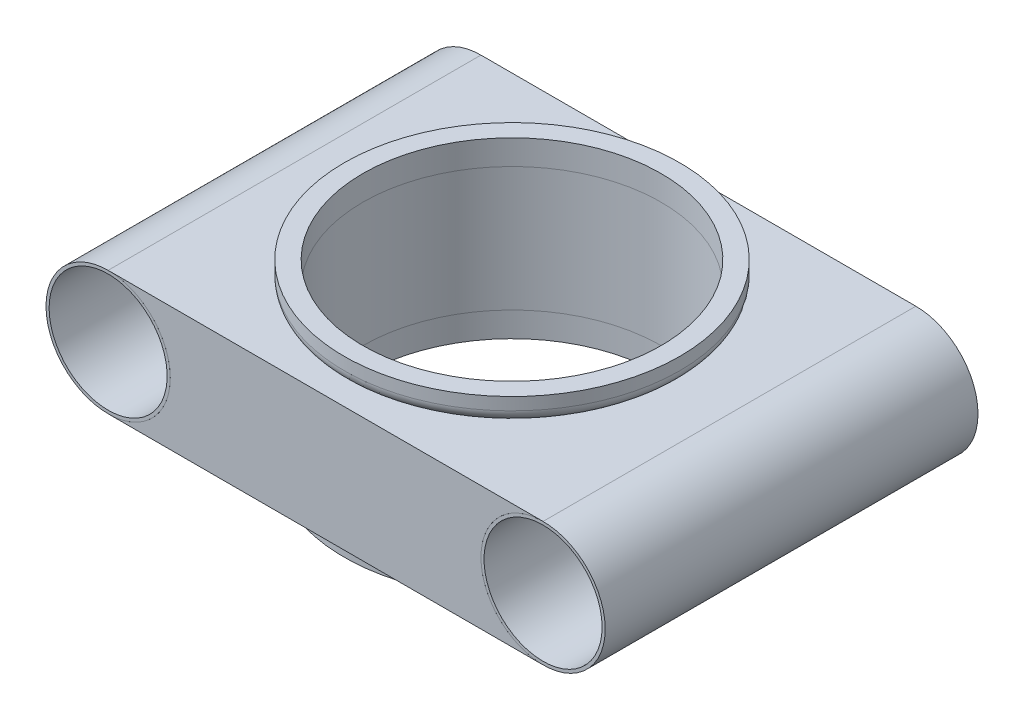
ISO-10303-21;
HEADER;
FILE_DESCRIPTION(('STEP AP214'),'2;1');
FILE_NAME('part.step','',(''),(''),'','','');
FILE_SCHEMA(('AUTOMOTIVE_DESIGN { 1 0 10303 214 1 1 1 1 }'));
ENDSEC;
DATA;
#1=APPLICATION_CONTEXT('core data for automotive mechanical design processes');
#2=APPLICATION_PROTOCOL_DEFINITION('international standard','automotive_design',2000,#1);
#3=PRODUCT_CONTEXT('',#1,'mechanical');
#4=PRODUCT('Part','Part','',(#3));
#5=PRODUCT_RELATED_PRODUCT_CATEGORY('part','',(#4));
#6=PRODUCT_DEFINITION_FORMATION('','',#4);
#7=PRODUCT_DEFINITION_CONTEXT('part definition',#1,'design');
#8=PRODUCT_DEFINITION('design','',#6,#7);
#9=PRODUCT_DEFINITION_SHAPE('','',#8);
#10=(LENGTH_UNIT() NAMED_UNIT(*) SI_UNIT(.MILLI.,.METRE.));
#11=(NAMED_UNIT(*) PLANE_ANGLE_UNIT() SI_UNIT($,.RADIAN.));
#12=(NAMED_UNIT(*) SI_UNIT($,.STERADIAN.) SOLID_ANGLE_UNIT());
#13=UNCERTAINTY_MEASURE_WITH_UNIT(LENGTH_MEASURE(1.E-05),#10,'distance_accuracy_value','');
#14=(GEOMETRIC_REPRESENTATION_CONTEXT(3) GLOBAL_UNCERTAINTY_ASSIGNED_CONTEXT((#13)) GLOBAL_UNIT_ASSIGNED_CONTEXT((#10,
#11,#12)) REPRESENTATION_CONTEXT('',''));
#15=CARTESIAN_POINT('',(0.,0.,0.));
#16=DIRECTION('',(0.,0.,1.));
#17=DIRECTION('',(1.,0.,0.));
#18=AXIS2_PLACEMENT_3D('',#15,#16,#17);
#19=CARTESIAN_POINT('',(0.,-7.,0.));
#20=DIRECTION('',(0.,-1.,0.));
#21=DIRECTION('',(-1.,0.,0.));
#22=AXIS2_PLACEMENT_3D('',#19,#20,#21);
#23=PLANE('',#22);
#24=CARTESIAN_POINT('',(0.,-7.,0.));
#25=DIRECTION('',(0.,1.,0.));
#26=DIRECTION('',(-1.,0.,0.));
#27=AXIS2_PLACEMENT_3D('',#24,#25,#26);
#28=CIRCLE('',#27,13.5);
#29=CARTESIAN_POINT('',(-13.5,-7.,0.));
#30=VERTEX_POINT('',#29);
#31=EDGE_CURVE('E63',#30,#30,#28,.T.);
#32=ORIENTED_EDGE('',*,*,#31,.F.);
#33=EDGE_LOOP('',(#32));
#34=FACE_BOUND('',#33,.T.);
#35=CARTESIAN_POINT('',(0.,-7.,0.));
#36=DIRECTION('',(0.,1.,0.));
#37=DIRECTION('',(-1.,0.,0.));
#38=AXIS2_PLACEMENT_3D('',#35,#36,#37);
#39=CIRCLE('',#38,12.);
#40=CARTESIAN_POINT('',(-12.,-7.,0.));
#41=VERTEX_POINT('',#40);
#42=EDGE_CURVE('E67',#41,#41,#39,.T.);
#43=ORIENTED_EDGE('',*,*,#42,.T.);
#44=EDGE_LOOP('',(#43));
#45=FACE_BOUND('',#44,.T.);
#46=ADVANCED_FACE('F52',(#34,#45),#23,.T.);
#47=CARTESIAN_POINT('',(0.,-5.,0.));
#48=DIRECTION('',(0.,-1.,0.));
#49=DIRECTION('',(-1.,0.,0.));
#50=AXIS2_PLACEMENT_3D('',#47,#48,#49);
#51=PLANE('',#50);
#52=CARTESIAN_POINT('',(0.,-5.,0.));
#53=DIRECTION('',(0.,1.,0.));
#54=DIRECTION('',(-1.,0.,0.));
#55=AXIS2_PLACEMENT_3D('',#52,#53,#54);
#56=CIRCLE('',#55,12.5);
#57=CARTESIAN_POINT('',(-12.5,-5.,0.));
#58=VERTEX_POINT('',#57);
#59=EDGE_CURVE('E12',#58,#58,#56,.F.);
#60=ORIENTED_EDGE('',*,*,#59,.F.);
#61=EDGE_LOOP('',(#60));
#62=FACE_BOUND('',#61,.T.);
#63=CARTESIAN_POINT('',(0.,-5.,0.));
#64=DIRECTION('',(0.,1.,0.));
#65=DIRECTION('',(-1.,0.,0.));
#66=AXIS2_PLACEMENT_3D('',#63,#64,#65);
#67=CIRCLE('',#66,12.);
#68=CARTESIAN_POINT('',(-12.,-5.,0.));
#69=VERTEX_POINT('',#68);
#70=EDGE_CURVE('E70',#69,#69,#67,.T.);
#71=ORIENTED_EDGE('',*,*,#70,.F.);
#72=EDGE_LOOP('',(#71));
#73=FACE_BOUND('',#72,.T.);
#74=ADVANCED_FACE('F84',(#62,#73),#51,.F.);
#75=CARTESIAN_POINT('',(0.,-7.,0.));
#76=DIRECTION('',(0.,1.,0.));
#77=DIRECTION('',(1.,0.,0.));
#78=AXIS2_PLACEMENT_3D('',#75,#76,#77);
#79=CYLINDRICAL_SURFACE('',#78,13.5);
#80=CARTESIAN_POINT('',(0.,-6.,0.));
#81=DIRECTION('',(0.,1.,0.));
#82=DIRECTION('',(-1.,0.,0.));
#83=AXIS2_PLACEMENT_3D('',#80,#81,#82);
#84=CIRCLE('',#83,13.5);
#85=CARTESIAN_POINT('',(-13.5,-6.,0.));
#86=VERTEX_POINT('',#85);
#87=EDGE_CURVE('E59',#86,#86,#84,.T.);
#88=ORIENTED_EDGE('',*,*,#87,.F.);
#89=EDGE_LOOP('',(#88));
#90=FACE_BOUND('',#89,.T.);
#91=ORIENTED_EDGE('',*,*,#31,.T.);
#92=EDGE_LOOP('',(#91));
#93=FACE_BOUND('',#92,.T.);
#94=ADVANCED_FACE('F80',(#90,#93),#79,.T.);
#95=CARTESIAN_POINT('',(0.,-7.,0.));
#96=DIRECTION('',(0.,1.,0.));
#97=DIRECTION('',(1.,0.,0.));
#98=AXIS2_PLACEMENT_3D('',#95,#96,#97);
#99=CYLINDRICAL_SURFACE('',#98,12.);
#100=ORIENTED_EDGE('',*,*,#42,.F.);
#101=EDGE_LOOP('',(#100));
#102=FACE_BOUND('',#101,.T.);
#103=ORIENTED_EDGE('',*,*,#70,.T.);
#104=EDGE_LOOP('',(#103));
#105=FACE_BOUND('',#104,.T.);
#106=ADVANCED_FACE('F77',(#102,#105),#99,.F.);
#107=CARTESIAN_POINT('',(0.,-6.,0.));
#108=DIRECTION('',(0.,-1.,0.));
#109=DIRECTION('',(-1.,0.,0.));
#110=AXIS2_PLACEMENT_3D('',#107,#108,#109);
#111=TOROIDAL_SURFACE('',#110,12.5,1.);
#112=ORIENTED_EDGE('',*,*,#59,.T.);
#113=EDGE_LOOP('',(#112));
#114=FACE_BOUND('',#113,.T.);
#115=ORIENTED_EDGE('',*,*,#87,.T.);
#116=EDGE_LOOP('',(#115));
#117=FACE_BOUND('',#116,.T.);
#118=ADVANCED_FACE('F54',(#114,#117),#111,.T.);
#119=CLOSED_SHELL('',(#46,#74,#94,#106,#118));
#120=MANIFOLD_SOLID_BREP('B2',#119);
#121=CARTESIAN_POINT('',(0.,7.,0.));
#122=DIRECTION('',(0.,1.,0.));
#123=DIRECTION('',(-1.,0.,0.));
#124=AXIS2_PLACEMENT_3D('',#121,#122,#123);
#125=PLANE('',#124);
#126=CARTESIAN_POINT('',(0.,7.,0.));
#127=DIRECTION('',(0.,1.,0.));
#128=DIRECTION('',(-1.,0.,0.));
#129=AXIS2_PLACEMENT_3D('',#126,#127,#128);
#130=CIRCLE('',#129,13.5);
#131=CARTESIAN_POINT('',(-13.5,7.,0.));
#132=VERTEX_POINT('',#131);
#133=EDGE_CURVE('E149',#132,#132,#130,.T.);
#134=ORIENTED_EDGE('',*,*,#133,.T.);
#135=EDGE_LOOP('',(#134));
#136=FACE_BOUND('',#135,.T.);
#137=CARTESIAN_POINT('',(0.,7.,0.));
#138=DIRECTION('',(0.,1.,0.));
#139=DIRECTION('',(-1.,0.,0.));
#140=AXIS2_PLACEMENT_3D('',#137,#138,#139);
#141=CIRCLE('',#140,12.);
#142=CARTESIAN_POINT('',(-12.,7.,0.));
#143=VERTEX_POINT('',#142);
#144=EDGE_CURVE('E153',#143,#143,#141,.T.);
#145=ORIENTED_EDGE('',*,*,#144,.F.);
#146=EDGE_LOOP('',(#145));
#147=FACE_BOUND('',#146,.T.);
#148=ADVANCED_FACE('F138',(#136,#147),#125,.T.);
#149=CARTESIAN_POINT('',(0.,5.,0.));
#150=DIRECTION('',(0.,1.,0.));
#151=DIRECTION('',(-1.,0.,0.));
#152=AXIS2_PLACEMENT_3D('',#149,#150,#151);
#153=PLANE('',#152);
#154=CARTESIAN_POINT('',(0.,5.,0.));
#155=DIRECTION('',(0.,1.,0.));
#156=DIRECTION('',(-1.,0.,0.));
#157=AXIS2_PLACEMENT_3D('',#154,#155,#156);
#158=CIRCLE('',#157,12.5);
#159=CARTESIAN_POINT('',(-12.5,5.,0.));
#160=VERTEX_POINT('',#159);
#161=EDGE_CURVE('E51',#160,#160,#158,.F.);
#162=ORIENTED_EDGE('',*,*,#161,.T.);
#163=EDGE_LOOP('',(#162));
#164=FACE_BOUND('',#163,.T.);
#165=CARTESIAN_POINT('',(0.,5.,0.));
#166=DIRECTION('',(0.,1.,0.));
#167=DIRECTION('',(-1.,0.,0.));
#168=AXIS2_PLACEMENT_3D('',#165,#166,#167);
#169=CIRCLE('',#168,12.);
#170=CARTESIAN_POINT('',(-12.,5.,0.));
#171=VERTEX_POINT('',#170);
#172=EDGE_CURVE('E156',#171,#171,#169,.T.);
#173=ORIENTED_EDGE('',*,*,#172,.T.);
#174=EDGE_LOOP('',(#173));
#175=FACE_BOUND('',#174,.T.);
#176=ADVANCED_FACE('F166',(#164,#175),#153,.F.);
#177=CARTESIAN_POINT('',(0.,7.,0.));
#178=DIRECTION('',(0.,-1.,0.));
#179=DIRECTION('',(1.,0.,0.));
#180=AXIS2_PLACEMENT_3D('',#177,#178,#179);
#181=CYLINDRICAL_SURFACE('',#180,13.5);
#182=CARTESIAN_POINT('',(0.,6.,0.));
#183=DIRECTION('',(0.,1.,0.));
#184=DIRECTION('',(-1.,0.,0.));
#185=AXIS2_PLACEMENT_3D('',#182,#183,#184);
#186=CIRCLE('',#185,13.5);
#187=CARTESIAN_POINT('',(-13.5,6.,0.));
#188=VERTEX_POINT('',#187);
#189=EDGE_CURVE('E145',#188,#188,#186,.T.);
#190=ORIENTED_EDGE('',*,*,#189,.T.);
#191=EDGE_LOOP('',(#190));
#192=FACE_BOUND('',#191,.T.);
#193=ORIENTED_EDGE('',*,*,#133,.F.);
#194=EDGE_LOOP('',(#193));
#195=FACE_BOUND('',#194,.T.);
#196=ADVANCED_FACE('F172',(#192,#195),#181,.T.);
#197=CARTESIAN_POINT('',(0.,7.,0.));
#198=DIRECTION('',(0.,-1.,0.));
#199=DIRECTION('',(1.,0.,0.));
#200=AXIS2_PLACEMENT_3D('',#197,#198,#199);
#201=CYLINDRICAL_SURFACE('',#200,12.);
#202=ORIENTED_EDGE('',*,*,#144,.T.);
#203=EDGE_LOOP('',(#202));
#204=FACE_BOUND('',#203,.T.);
#205=ORIENTED_EDGE('',*,*,#172,.F.);
#206=EDGE_LOOP('',(#205));
#207=FACE_BOUND('',#206,.T.);
#208=ADVANCED_FACE('F162',(#204,#207),#201,.F.);
#209=CARTESIAN_POINT('',(0.,6.,0.));
#210=DIRECTION('',(0.,1.,0.));
#211=DIRECTION('',(-1.,0.,0.));
#212=AXIS2_PLACEMENT_3D('',#209,#210,#211);
#213=TOROIDAL_SURFACE('',#212,12.5,1.);
#214=ORIENTED_EDGE('',*,*,#161,.F.);
#215=EDGE_LOOP('',(#214));
#216=FACE_BOUND('',#215,.T.);
#217=ORIENTED_EDGE('',*,*,#189,.F.);
#218=EDGE_LOOP('',(#217));
#219=FACE_BOUND('',#218,.T.);
#220=ADVANCED_FACE('F140',(#216,#219),#213,.T.);
#221=CLOSED_SHELL('',(#148,#176,#196,#208,#220));
#222=MANIFOLD_SOLID_BREP('B7',#221);
#223=CARTESIAN_POINT('',(17.5,0.,15.));
#224=DIRECTION('',(0.,0.,-1.));
#225=DIRECTION('',(-1.,0.,0.));
#226=AXIS2_PLACEMENT_3D('',#223,#224,#225);
#227=CYLINDRICAL_SURFACE('',#226,5.);
#228=CARTESIAN_POINT('',(17.5,0.,-15.));
#229=DIRECTION('',(0.,0.,1.));
#230=DIRECTION('',(1.,0.,0.));
#231=AXIS2_PLACEMENT_3D('',#228,#229,#230);
#232=CIRCLE('',#231,5.);
#233=CARTESIAN_POINT('',(17.5,5.,-15.));
#234=VERTEX_POINT('',#233);
#235=CARTESIAN_POINT('',(17.5,-5.,-15.));
#236=VERTEX_POINT('',#235);
#237=EDGE_CURVE('E285',#234,#236,#232,.T.);
#238=ORIENTED_EDGE('',*,*,#237,.F.);
#239=DIRECTION('',(0.,0.,-1.));
#240=VECTOR('',#239,1.);
#241=CARTESIAN_POINT('',(17.5,5.,15.));
#242=LINE('',#241,#240);
#243=CARTESIAN_POINT('',(17.5,5.,15.));
#244=VERTEX_POINT('',#243);
#245=EDGE_CURVE('E136',#244,#234,#242,.T.);
#246=ORIENTED_EDGE('',*,*,#245,.F.);
#247=CARTESIAN_POINT('',(17.5,0.,15.));
#248=DIRECTION('',(0.,0.,1.));
#249=DIRECTION('',(1.,0.,0.));
#250=AXIS2_PLACEMENT_3D('',#247,#248,#249);
#251=CIRCLE('',#250,5.);
#252=CARTESIAN_POINT('',(17.5,-5.,15.));
#253=VERTEX_POINT('',#252);
#254=EDGE_CURVE('E277',#244,#253,#251,.T.);
#255=ORIENTED_EDGE('',*,*,#254,.T.);
#256=DIRECTION('',(0.,0.,-1.));
#257=VECTOR('',#256,1.);
#258=CARTESIAN_POINT('',(17.5,-5.,15.));
#259=LINE('',#258,#257);
#260=EDGE_CURVE('E238',#253,#236,#259,.T.);
#261=ORIENTED_EDGE('',*,*,#260,.T.);
#262=EDGE_LOOP('',(#238,#246,#255,#261));
#263=FACE_BOUND('',#262,.T.);
#264=ADVANCED_FACE('F222',(#263),#227,.F.);
#265=CARTESIAN_POINT('',(0.,5.,15.));
#266=DIRECTION('',(0.,1.,0.));
#267=DIRECTION('',(-1.,0.,0.));
#268=AXIS2_PLACEMENT_3D('',#265,#266,#267);
#269=PLANE('',#268);
#270=CARTESIAN_POINT('',(0.,5.,0.));
#271=DIRECTION('',(0.,1.,0.));
#272=DIRECTION('',(-1.,0.,0.));
#273=AXIS2_PLACEMENT_3D('',#270,#271,#272);
#274=CIRCLE('',#273,12.);
#275=CARTESIAN_POINT('',(-12.,5.,0.));
#276=VERTEX_POINT('',#275);
#277=EDGE_CURVE('E287',#276,#276,#274,.T.);
#278=ORIENTED_EDGE('',*,*,#277,.F.);
#279=EDGE_LOOP('',(#278));
#280=FACE_BOUND('',#279,.T.);
#281=DIRECTION('',(1.,0.,0.));
#282=VECTOR('',#281,1.);
#283=CARTESIAN_POINT('',(0.,5.,-15.));
#284=LINE('',#283,#282);
#285=CARTESIAN_POINT('',(-17.5,5.,-15.));
#286=VERTEX_POINT('',#285);
#287=EDGE_CURVE('E268',#286,#234,#284,.T.);
#288=ORIENTED_EDGE('',*,*,#287,.F.);
#289=DIRECTION('',(0.,0.,-1.));
#290=VECTOR('',#289,1.);
#291=CARTESIAN_POINT('',(-17.5,5.,15.));
#292=LINE('',#291,#290);
#293=CARTESIAN_POINT('',(-17.5,5.,15.));
#294=VERTEX_POINT('',#293);
#295=EDGE_CURVE('E230',#294,#286,#292,.T.);
#296=ORIENTED_EDGE('',*,*,#295,.F.);
#297=DIRECTION('',(1.,0.,0.));
#298=VECTOR('',#297,1.);
#299=CARTESIAN_POINT('',(0.,5.,15.));
#300=LINE('',#299,#298);
#301=EDGE_CURVE('E266',#294,#244,#300,.T.);
#302=ORIENTED_EDGE('',*,*,#301,.T.);
#303=ORIENTED_EDGE('',*,*,#245,.T.);
#304=EDGE_LOOP('',(#288,#296,#302,#303));
#305=FACE_BOUND('',#304,.T.);
#306=ADVANCED_FACE('F265',(#280,#305),#269,.T.);
#307=CARTESIAN_POINT('',(-17.5,0.,15.));
#308=DIRECTION('',(0.,0.,-1.));
#309=DIRECTION('',(-1.,0.,0.));
#310=AXIS2_PLACEMENT_3D('',#307,#308,#309);
#311=CYLINDRICAL_SURFACE('',#310,5.);
#312=CARTESIAN_POINT('',(-17.5,0.,-15.));
#313=DIRECTION('',(0.,0.,1.));
#314=DIRECTION('',(1.,0.,0.));
#315=AXIS2_PLACEMENT_3D('',#312,#313,#314);
#316=CIRCLE('',#315,5.);
#317=CARTESIAN_POINT('',(-17.5,-5.,-15.));
#318=VERTEX_POINT('',#317);
#319=EDGE_CURVE('E289',#318,#286,#316,.T.);
#320=ORIENTED_EDGE('',*,*,#319,.F.);
#321=DIRECTION('',(0.,0.,-1.));
#322=VECTOR('',#321,1.);
#323=CARTESIAN_POINT('',(-17.5,-5.,15.));
#324=LINE('',#323,#322);
#325=CARTESIAN_POINT('',(-17.5,-5.,15.));
#326=VERTEX_POINT('',#325);
#327=EDGE_CURVE('E251',#326,#318,#324,.T.);
#328=ORIENTED_EDGE('',*,*,#327,.F.);
#329=CARTESIAN_POINT('',(-17.5,0.,15.));
#330=DIRECTION('',(0.,0.,1.));
#331=DIRECTION('',(1.,0.,0.));
#332=AXIS2_PLACEMENT_3D('',#329,#330,#331);
#333=CIRCLE('',#332,5.);
#334=EDGE_CURVE('E276',#326,#294,#333,.T.);
#335=ORIENTED_EDGE('',*,*,#334,.T.);
#336=ORIENTED_EDGE('',*,*,#295,.T.);
#337=EDGE_LOOP('',(#320,#328,#335,#336));
#338=FACE_BOUND('',#337,.T.);
#339=ADVANCED_FACE('F279',(#338),#311,.F.);
#340=CARTESIAN_POINT('',(0.,-5.,15.));
#341=DIRECTION('',(0.,-1.,0.));
#342=DIRECTION('',(1.,0.,0.));
#343=AXIS2_PLACEMENT_3D('',#340,#341,#342);
#344=PLANE('',#343);
#345=CARTESIAN_POINT('',(0.,-5.,0.));
#346=DIRECTION('',(0.,1.,0.));
#347=DIRECTION('',(-1.,0.,0.));
#348=AXIS2_PLACEMENT_3D('',#345,#346,#347);
#349=CIRCLE('',#348,12.);
#350=CARTESIAN_POINT('',(-12.,-5.,0.));
#351=VERTEX_POINT('',#350);
#352=EDGE_CURVE('E299',#351,#351,#349,.T.);
#353=ORIENTED_EDGE('',*,*,#352,.T.);
#354=EDGE_LOOP('',(#353));
#355=FACE_BOUND('',#354,.T.);
#356=DIRECTION('',(-1.,0.,0.));
#357=VECTOR('',#356,1.);
#358=CARTESIAN_POINT('',(0.,-5.,-15.));
#359=LINE('',#358,#357);
#360=EDGE_CURVE('E291',#236,#318,#359,.T.);
#361=ORIENTED_EDGE('',*,*,#360,.F.);
#362=ORIENTED_EDGE('',*,*,#260,.F.);
#363=DIRECTION('',(-1.,0.,0.));
#364=VECTOR('',#363,1.);
#365=CARTESIAN_POINT('',(0.,-5.,15.));
#366=LINE('',#365,#364);
#367=EDGE_CURVE('E280',#253,#326,#366,.T.);
#368=ORIENTED_EDGE('',*,*,#367,.T.);
#369=ORIENTED_EDGE('',*,*,#327,.T.);
#370=EDGE_LOOP('',(#361,#362,#368,#369));
#371=FACE_BOUND('',#370,.T.);
#372=ADVANCED_FACE('F303',(#355,#371),#344,.T.);
#373=CARTESIAN_POINT('',(0.,0.,15.));
#374=DIRECTION('',(0.,0.,1.));
#375=DIRECTION('',(1.,0.,0.));
#376=AXIS2_PLACEMENT_3D('',#373,#374,#375);
#377=PLANE('',#376);
#378=ORIENTED_EDGE('',*,*,#254,.F.);
#379=ORIENTED_EDGE('',*,*,#301,.F.);
#380=ORIENTED_EDGE('',*,*,#334,.F.);
#381=ORIENTED_EDGE('',*,*,#367,.F.);
#382=EDGE_LOOP('',(#378,#379,#380,#381));
#383=FACE_BOUND('',#382,.T.);
#384=ADVANCED_FACE('F274',(#383),#377,.T.);
#385=CARTESIAN_POINT('',(0.,0.,-15.));
#386=DIRECTION('',(0.,0.,1.));
#387=DIRECTION('',(1.,0.,0.));
#388=AXIS2_PLACEMENT_3D('',#385,#386,#387);
#389=PLANE('',#388);
#390=ORIENTED_EDGE('',*,*,#237,.T.);
#391=ORIENTED_EDGE('',*,*,#360,.T.);
#392=ORIENTED_EDGE('',*,*,#319,.T.);
#393=ORIENTED_EDGE('',*,*,#287,.T.);
#394=EDGE_LOOP('',(#390,#391,#392,#393));
#395=FACE_BOUND('',#394,.T.);
#396=ADVANCED_FACE('F307',(#395),#389,.F.);
#397=CARTESIAN_POINT('',(0.,-5.,0.));
#398=DIRECTION('',(0.,1.,0.));
#399=DIRECTION('',(-1.,0.,0.));
#400=AXIS2_PLACEMENT_3D('',#397,#398,#399);
#401=CYLINDRICAL_SURFACE('',#400,12.);
#402=ORIENTED_EDGE('',*,*,#277,.T.);
#403=EDGE_LOOP('',(#402));
#404=FACE_BOUND('',#403,.T.);
#405=ORIENTED_EDGE('',*,*,#352,.F.);
#406=EDGE_LOOP('',(#405));
#407=FACE_BOUND('',#406,.T.);
#408=ADVANCED_FACE('F305',(#404,#407),#401,.F.);
#409=CLOSED_SHELL('',(#264,#306,#339,#372,#384,#396,#408));
#410=MANIFOLD_SOLID_BREP('B46',#409);
#411=CARTESIAN_POINT('',(17.5,0.,15.));
#412=DIRECTION('',(0.,0.,-1.));
#413=DIRECTION('',(-1.,0.,0.));
#414=AXIS2_PLACEMENT_3D('',#411,#412,#413);
#415=CYLINDRICAL_SURFACE('',#414,4.75);
#416=CARTESIAN_POINT('',(17.5,0.,15.));
#417=DIRECTION('',(0.,0.,1.));
#418=DIRECTION('',(1.,0.,0.));
#419=AXIS2_PLACEMENT_3D('',#416,#417,#418);
#420=CIRCLE('',#419,4.75);
#421=CARTESIAN_POINT('',(22.25,0.,15.));
#422=VERTEX_POINT('',#421);
#423=EDGE_CURVE('E403',#422,#422,#420,.T.);
#424=ORIENTED_EDGE('',*,*,#423,.T.);
#425=EDGE_LOOP('',(#424));
#426=FACE_BOUND('',#425,.T.);
#427=CARTESIAN_POINT('',(17.5,0.,-15.));
#428=DIRECTION('',(0.,0.,1.));
#429=DIRECTION('',(1.,0.,0.));
#430=AXIS2_PLACEMENT_3D('',#427,#428,#429);
#431=CIRCLE('',#430,4.75);
#432=CARTESIAN_POINT('',(22.25,0.,-15.));
#433=VERTEX_POINT('',#432);
#434=EDGE_CURVE('E409',#433,#433,#431,.T.);
#435=ORIENTED_EDGE('',*,*,#434,.F.);
#436=EDGE_LOOP('',(#435));
#437=FACE_BOUND('',#436,.T.);
#438=ADVANCED_FACE('F396',(#426,#437),#415,.F.);
#439=CARTESIAN_POINT('',(17.5,0.,15.));
#440=DIRECTION('',(0.,0.,-1.));
#441=DIRECTION('',(-1.,0.,0.));
#442=AXIS2_PLACEMENT_3D('',#439,#440,#441);
#443=CYLINDRICAL_SURFACE('',#442,5.);
#444=CARTESIAN_POINT('',(17.5,0.,15.));
#445=DIRECTION('',(0.,0.,1.));
#446=DIRECTION('',(1.,0.,0.));
#447=AXIS2_PLACEMENT_3D('',#444,#445,#446);
#448=CIRCLE('',#447,5.);
#449=CARTESIAN_POINT('',(22.5,0.,15.));
#450=VERTEX_POINT('',#449);
#451=EDGE_CURVE('E221',#450,#450,#448,.T.);
#452=ORIENTED_EDGE('',*,*,#451,.F.);
#453=EDGE_LOOP('',(#452));
#454=FACE_BOUND('',#453,.T.);
#455=CARTESIAN_POINT('',(17.5,0.,-15.));
#456=DIRECTION('',(0.,0.,1.));
#457=DIRECTION('',(1.,0.,0.));
#458=AXIS2_PLACEMENT_3D('',#455,#456,#457);
#459=CIRCLE('',#458,5.);
#460=CARTESIAN_POINT('',(22.5,0.,-15.));
#461=VERTEX_POINT('',#460);
#462=EDGE_CURVE('E399',#461,#461,#459,.T.);
#463=ORIENTED_EDGE('',*,*,#462,.T.);
#464=EDGE_LOOP('',(#463));
#465=FACE_BOUND('',#464,.T.);
#466=ADVANCED_FACE('F416',(#454,#465),#443,.T.);
#467=CARTESIAN_POINT('',(17.5,0.,15.));
#468=DIRECTION('',(0.,0.,1.));
#469=DIRECTION('',(1.,0.,0.));
#470=AXIS2_PLACEMENT_3D('',#467,#468,#469);
#471=PLANE('',#470);
#472=ORIENTED_EDGE('',*,*,#423,.F.);
#473=EDGE_LOOP('',(#472));
#474=FACE_BOUND('',#473,.T.);
#475=ORIENTED_EDGE('',*,*,#451,.T.);
#476=EDGE_LOOP('',(#475));
#477=FACE_BOUND('',#476,.T.);
#478=ADVANCED_FACE('F420',(#474,#477),#471,.T.);
#479=CARTESIAN_POINT('',(17.5,0.,-15.));
#480=DIRECTION('',(0.,0.,1.));
#481=DIRECTION('',(1.,0.,0.));
#482=AXIS2_PLACEMENT_3D('',#479,#480,#481);
#483=PLANE('',#482);
#484=ORIENTED_EDGE('',*,*,#434,.T.);
#485=EDGE_LOOP('',(#484));
#486=FACE_BOUND('',#485,.T.);
#487=ORIENTED_EDGE('',*,*,#462,.F.);
#488=EDGE_LOOP('',(#487));
#489=FACE_BOUND('',#488,.T.);
#490=ADVANCED_FACE('F418',(#486,#489),#483,.F.);
#491=CLOSED_SHELL('',(#438,#466,#478,#490));
#492=MANIFOLD_SOLID_BREP('B130',#491);
#493=CARTESIAN_POINT('',(-17.5,0.,15.));
#494=DIRECTION('',(0.,0.,-1.));
#495=DIRECTION('',(-1.,0.,0.));
#496=AXIS2_PLACEMENT_3D('',#493,#494,#495);
#497=CYLINDRICAL_SURFACE('',#496,4.75);
#498=CARTESIAN_POINT('',(-17.5,0.,15.));
#499=DIRECTION('',(0.,0.,1.));
#500=DIRECTION('',(1.,0.,0.));
#501=AXIS2_PLACEMENT_3D('',#498,#499,#500);
#502=CIRCLE('',#501,4.75);
#503=CARTESIAN_POINT('',(-22.25,0.,15.));
#504=VERTEX_POINT('',#503);
#505=EDGE_CURVE('E472',#504,#504,#502,.T.);
#506=CARTESIAN_POINT('',(-17.5,0.,-15.));
#507=DIRECTION('',(0.,0.,1.));
#508=DIRECTION('',(1.,0.,0.));
#509=AXIS2_PLACEMENT_3D('',#506,#507,#508);
#510=CIRCLE('',#509,4.75);
#511=CARTESIAN_POINT('',(-22.25,0.,-15.));
#512=VERTEX_POINT('',#511);
#513=EDGE_CURVE('E478',#512,#512,#510,.T.);
#514=CARTESIAN_POINT('',(-22.25,0.,15.));
#515=CARTESIAN_POINT('',(-22.25,0.,14.6875));
#516=CARTESIAN_POINT('',(-22.25,0.,14.375));
#517=CARTESIAN_POINT('',(-22.25,0.,13.75));
#518=CARTESIAN_POINT('',(-22.25,0.,13.4375));
#519=CARTESIAN_POINT('',(-22.25,0.,12.8125));
#520=CARTESIAN_POINT('',(-22.25,0.,12.5));
#521=CARTESIAN_POINT('',(-22.25,0.,11.875));
#522=CARTESIAN_POINT('',(-22.25,0.,11.5625));
#523=CARTESIAN_POINT('',(-22.25,0.,10.9375));
#524=CARTESIAN_POINT('',(-22.25,0.,10.625));
#525=CARTESIAN_POINT('',(-22.25,0.,10.));
#526=CARTESIAN_POINT('',(-22.25,0.,9.6875));
#527=CARTESIAN_POINT('',(-22.25,0.,9.0625));
#528=CARTESIAN_POINT('',(-22.25,0.,8.75));
#529=CARTESIAN_POINT('',(-22.25,0.,8.125));
#530=CARTESIAN_POINT('',(-22.25,0.,7.8125));
#531=CARTESIAN_POINT('',(-22.25,0.,7.1875));
#532=CARTESIAN_POINT('',(-22.25,0.,6.875));
#533=CARTESIAN_POINT('',(-22.25,0.,6.25));
#534=CARTESIAN_POINT('',(-22.25,0.,5.9375));
#535=CARTESIAN_POINT('',(-22.25,0.,5.3125));
#536=CARTESIAN_POINT('',(-22.25,0.,5.));
#537=CARTESIAN_POINT('',(-22.25,0.,4.375));
#538=CARTESIAN_POINT('',(-22.25,0.,4.0625));
#539=CARTESIAN_POINT('',(-22.25,0.,3.4375));
#540=CARTESIAN_POINT('',(-22.25,0.,3.125));
#541=CARTESIAN_POINT('',(-22.25,0.,2.5));
#542=CARTESIAN_POINT('',(-22.25,0.,2.1875));
#543=CARTESIAN_POINT('',(-22.25,0.,1.5625));
#544=CARTESIAN_POINT('',(-22.25,0.,1.25));
#545=CARTESIAN_POINT('',(-22.25,0.,0.624999999999999));
#546=CARTESIAN_POINT('',(-22.25,0.,0.3125));
#547=CARTESIAN_POINT('',(-22.25,0.,-0.3125));
#548=CARTESIAN_POINT('',(-22.25,0.,-0.624999999999999));
#549=CARTESIAN_POINT('',(-22.25,0.,-1.25));
#550=CARTESIAN_POINT('',(-22.25,0.,-1.5625));
#551=CARTESIAN_POINT('',(-22.25,0.,-2.1875));
#552=CARTESIAN_POINT('',(-22.25,0.,-2.5));
#553=CARTESIAN_POINT('',(-22.25,0.,-3.125));
#554=CARTESIAN_POINT('',(-22.25,0.,-3.4375));
#555=CARTESIAN_POINT('',(-22.25,0.,-4.0625));
#556=CARTESIAN_POINT('',(-22.25,0.,-4.375));
#557=CARTESIAN_POINT('',(-22.25,0.,-5.));
#558=CARTESIAN_POINT('',(-22.25,0.,-5.3125));
#559=CARTESIAN_POINT('',(-22.25,0.,-5.9375));
#560=CARTESIAN_POINT('',(-22.25,0.,-6.25));
#561=CARTESIAN_POINT('',(-22.25,0.,-6.875));
#562=CARTESIAN_POINT('',(-22.25,0.,-7.1875));
#563=CARTESIAN_POINT('',(-22.25,0.,-7.8125));
#564=CARTESIAN_POINT('',(-22.25,0.,-8.125));
#565=CARTESIAN_POINT('',(-22.25,0.,-8.75));
#566=CARTESIAN_POINT('',(-22.25,0.,-9.0625));
#567=CARTESIAN_POINT('',(-22.25,0.,-9.6875));
#568=CARTESIAN_POINT('',(-22.25,0.,-10.));
#569=CARTESIAN_POINT('',(-22.25,0.,-10.625));
#570=CARTESIAN_POINT('',(-22.25,0.,-10.9375));
#571=CARTESIAN_POINT('',(-22.25,0.,-11.5625));
#572=CARTESIAN_POINT('',(-22.25,0.,-11.875));
#573=CARTESIAN_POINT('',(-22.25,0.,-12.5));
#574=CARTESIAN_POINT('',(-22.25,0.,-12.8125));
#575=CARTESIAN_POINT('',(-22.25,0.,-13.4375));
#576=CARTESIAN_POINT('',(-22.25,0.,-13.75));
#577=CARTESIAN_POINT('',(-22.25,0.,-14.375));
#578=CARTESIAN_POINT('',(-22.25,0.,-14.6875));
#579=CARTESIAN_POINT('',(-22.25,0.,-15.));
#580=B_SPLINE_CURVE_WITH_KNOTS('',3,(#514,#515,#516,#517,#518,#519,#520,#521,#522,#523,#524,
#525,#526,#527,#528,#529,#530,#531,#532,#533,#534,#535,#536,#537,#538,#539,#540,#541,#542,#543,
#544,#545,#546,#547,#548,#549,#550,#551,#552,#553,#554,#555,#556,#557,#558,#559,#560,#561,#562,
#563,#564,#565,#566,#567,#568,#569,#570,#571,#572,#573,#574,#575,#576,#577,#578,#579),
.UNSPECIFIED.,.F.,.F.,(4,2,2,2,2,2,2,2,2,2,2,2,2,2,2,2,2,2,2,2,2,2,2,2,2,2,2,2,2,2,2,2,4),(0.,
0.937500000000001,1.875,2.8125,3.75,4.6875,5.625,6.5625,7.5,8.4375,9.375,10.3125,11.25,12.1875,
13.125,14.0625,15.,15.9375,16.875,17.8125,18.75,19.6875,20.625,21.5625,22.5,23.4375,24.375,
25.3125,26.25,27.1875,28.125,29.0625,30.),.UNSPECIFIED.);
#581=EDGE_CURVE('BSEAM465',#504,#512,#580,.T.);
#582=ORIENTED_EDGE('',*,*,#505,.T.);
#583=ORIENTED_EDGE('',*,*,#513,.F.);
#584=ORIENTED_EDGE('',*,*,#581,.T.);
#585=ORIENTED_EDGE('',*,*,#581,.F.);
#586=EDGE_LOOP('',(#582,#584,#583,#585));
#587=FACE_BOUND('',#586,.T.);
#588=ADVANCED_FACE('F465',(#587),#497,.F.);
#589=CARTESIAN_POINT('',(-17.5,0.,15.));
#590=DIRECTION('',(0.,0.,-1.));
#591=DIRECTION('',(-1.,0.,0.));
#592=AXIS2_PLACEMENT_3D('',#589,#590,#591);
#593=CYLINDRICAL_SURFACE('',#592,5.);
#594=CARTESIAN_POINT('',(-17.5,0.,15.));
#595=DIRECTION('',(0.,0.,1.));
#596=DIRECTION('',(1.,0.,0.));
#597=AXIS2_PLACEMENT_3D('',#594,#595,#596);
#598=CIRCLE('',#597,5.);
#599=CARTESIAN_POINT('',(-22.5,0.,15.));
#600=VERTEX_POINT('',#599);
#601=EDGE_CURVE('E395',#600,#600,#598,.T.);
#602=CARTESIAN_POINT('',(-17.5,0.,-15.));
#603=DIRECTION('',(0.,0.,1.));
#604=DIRECTION('',(1.,0.,0.));
#605=AXIS2_PLACEMENT_3D('',#602,#603,#604);
#606=CIRCLE('',#605,5.);
#607=CARTESIAN_POINT('',(-22.5,0.,-15.));
#608=VERTEX_POINT('',#607);
#609=EDGE_CURVE('E468',#608,#608,#606,.T.);
#610=CARTESIAN_POINT('',(-22.5,0.,15.));
#611=CARTESIAN_POINT('',(-22.5,0.,14.6875));
#612=CARTESIAN_POINT('',(-22.5,0.,14.375));
#613=CARTESIAN_POINT('',(-22.5,0.,13.75));
#614=CARTESIAN_POINT('',(-22.5,0.,13.4375));
#615=CARTESIAN_POINT('',(-22.5,0.,12.8125));
#616=CARTESIAN_POINT('',(-22.5,0.,12.5));
#617=CARTESIAN_POINT('',(-22.5,0.,11.875));
#618=CARTESIAN_POINT('',(-22.5,0.,11.5625));
#619=CARTESIAN_POINT('',(-22.5,0.,10.9375));
#620=CARTESIAN_POINT('',(-22.5,0.,10.625));
#621=CARTESIAN_POINT('',(-22.5,0.,10.));
#622=CARTESIAN_POINT('',(-22.5,0.,9.6875));
#623=CARTESIAN_POINT('',(-22.5,0.,9.0625));
#624=CARTESIAN_POINT('',(-22.5,0.,8.75));
#625=CARTESIAN_POINT('',(-22.5,0.,8.125));
#626=CARTESIAN_POINT('',(-22.5,0.,7.8125));
#627=CARTESIAN_POINT('',(-22.5,0.,7.1875));
#628=CARTESIAN_POINT('',(-22.5,0.,6.875));
#629=CARTESIAN_POINT('',(-22.5,0.,6.25));
#630=CARTESIAN_POINT('',(-22.5,0.,5.9375));
#631=CARTESIAN_POINT('',(-22.5,0.,5.3125));
#632=CARTESIAN_POINT('',(-22.5,0.,5.));
#633=CARTESIAN_POINT('',(-22.5,0.,4.375));
#634=CARTESIAN_POINT('',(-22.5,0.,4.0625));
#635=CARTESIAN_POINT('',(-22.5,0.,3.4375));
#636=CARTESIAN_POINT('',(-22.5,0.,3.125));
#637=CARTESIAN_POINT('',(-22.5,0.,2.5));
#638=CARTESIAN_POINT('',(-22.5,0.,2.1875));
#639=CARTESIAN_POINT('',(-22.5,0.,1.5625));
#640=CARTESIAN_POINT('',(-22.5,0.,1.25));
#641=CARTESIAN_POINT('',(-22.5,0.,0.624999999999999));
#642=CARTESIAN_POINT('',(-22.5,0.,0.3125));
#643=CARTESIAN_POINT('',(-22.5,0.,-0.3125));
#644=CARTESIAN_POINT('',(-22.5,0.,-0.624999999999999));
#645=CARTESIAN_POINT('',(-22.5,0.,-1.25));
#646=CARTESIAN_POINT('',(-22.5,0.,-1.5625));
#647=CARTESIAN_POINT('',(-22.5,0.,-2.1875));
#648=CARTESIAN_POINT('',(-22.5,0.,-2.5));
#649=CARTESIAN_POINT('',(-22.5,0.,-3.125));
#650=CARTESIAN_POINT('',(-22.5,0.,-3.4375));
#651=CARTESIAN_POINT('',(-22.5,0.,-4.0625));
#652=CARTESIAN_POINT('',(-22.5,0.,-4.375));
#653=CARTESIAN_POINT('',(-22.5,0.,-5.));
#654=CARTESIAN_POINT('',(-22.5,0.,-5.3125));
#655=CARTESIAN_POINT('',(-22.5,0.,-5.9375));
#656=CARTESIAN_POINT('',(-22.5,0.,-6.25));
#657=CARTESIAN_POINT('',(-22.5,0.,-6.875));
#658=CARTESIAN_POINT('',(-22.5,0.,-7.1875));
#659=CARTESIAN_POINT('',(-22.5,0.,-7.8125));
#660=CARTESIAN_POINT('',(-22.5,0.,-8.125));
#661=CARTESIAN_POINT('',(-22.5,0.,-8.75));
#662=CARTESIAN_POINT('',(-22.5,0.,-9.0625));
#663=CARTESIAN_POINT('',(-22.5,0.,-9.6875));
#664=CARTESIAN_POINT('',(-22.5,0.,-10.));
#665=CARTESIAN_POINT('',(-22.5,0.,-10.625));
#666=CARTESIAN_POINT('',(-22.5,0.,-10.9375));
#667=CARTESIAN_POINT('',(-22.5,0.,-11.5625));
#668=CARTESIAN_POINT('',(-22.5,0.,-11.875));
#669=CARTESIAN_POINT('',(-22.5,0.,-12.5));
#670=CARTESIAN_POINT('',(-22.5,0.,-12.8125));
#671=CARTESIAN_POINT('',(-22.5,0.,-13.4375));
#672=CARTESIAN_POINT('',(-22.5,0.,-13.75));
#673=CARTESIAN_POINT('',(-22.5,0.,-14.375));
#674=CARTESIAN_POINT('',(-22.5,0.,-14.6875));
#675=CARTESIAN_POINT('',(-22.5,0.,-15.));
#676=B_SPLINE_CURVE_WITH_KNOTS('',3,(#610,#611,#612,#613,#614,#615,#616,#617,#618,#619,#620,
#621,#622,#623,#624,#625,#626,#627,#628,#629,#630,#631,#632,#633,#634,#635,#636,#637,#638,#639,
#640,#641,#642,#643,#644,#645,#646,#647,#648,#649,#650,#651,#652,#653,#654,#655,#656,#657,#658,
#659,#660,#661,#662,#663,#664,#665,#666,#667,#668,#669,#670,#671,#672,#673,#674,#675),
.UNSPECIFIED.,.F.,.F.,(4,2,2,2,2,2,2,2,2,2,2,2,2,2,2,2,2,2,2,2,2,2,2,2,2,2,2,2,2,2,2,2,4),(0.,
0.937500000000001,1.875,2.8125,3.75,4.6875,5.625,6.5625,7.5,8.4375,9.375,10.3125,11.25,12.1875,
13.125,14.0625,15.,15.9375,16.875,17.8125,18.75,19.6875,20.625,21.5625,22.5,23.4375,24.375,
25.3125,26.25,27.1875,28.125,29.0625,30.),.UNSPECIFIED.);
#677=EDGE_CURVE('BSEAM485',#600,#608,#676,.T.);
#678=ORIENTED_EDGE('',*,*,#601,.F.);
#679=ORIENTED_EDGE('',*,*,#609,.T.);
#680=ORIENTED_EDGE('',*,*,#677,.T.);
#681=ORIENTED_EDGE('',*,*,#677,.F.);
#682=EDGE_LOOP('',(#678,#680,#679,#681));
#683=FACE_BOUND('',#682,.T.);
#684=ADVANCED_FACE('F485',(#683),#593,.T.);
#685=CARTESIAN_POINT('',(-17.5,0.,15.));
#686=DIRECTION('',(0.,0.,1.));
#687=DIRECTION('',(1.,0.,0.));
#688=AXIS2_PLACEMENT_3D('',#685,#686,#687);
#689=PLANE('',#688);
#690=ORIENTED_EDGE('',*,*,#505,.F.);
#691=EDGE_LOOP('',(#690));
#692=FACE_BOUND('',#691,.T.);
#693=ORIENTED_EDGE('',*,*,#601,.T.);
#694=EDGE_LOOP('',(#693));
#695=FACE_BOUND('',#694,.T.);
#696=ADVANCED_FACE('F489',(#692,#695),#689,.T.);
#697=CARTESIAN_POINT('',(-17.5,0.,-15.));
#698=DIRECTION('',(0.,0.,1.));
#699=DIRECTION('',(1.,0.,0.));
#700=AXIS2_PLACEMENT_3D('',#697,#698,#699);
#701=PLANE('',#700);
#702=ORIENTED_EDGE('',*,*,#513,.T.);
#703=EDGE_LOOP('',(#702));
#704=FACE_BOUND('',#703,.T.);
#705=ORIENTED_EDGE('',*,*,#609,.F.);
#706=EDGE_LOOP('',(#705));
#707=FACE_BOUND('',#706,.T.);
#708=ADVANCED_FACE('F487',(#704,#707),#701,.F.);
#709=CLOSED_SHELL('',(#588,#684,#696,#708));
#710=MANIFOLD_SOLID_BREP('B216',#709);
#711=ADVANCED_BREP_SHAPE_REPRESENTATION('',(#18,#120,#222,#410,#492,#710),#14);
#712=SHAPE_DEFINITION_REPRESENTATION(#9,#711);
ENDSEC;
END-ISO-10303-21;
